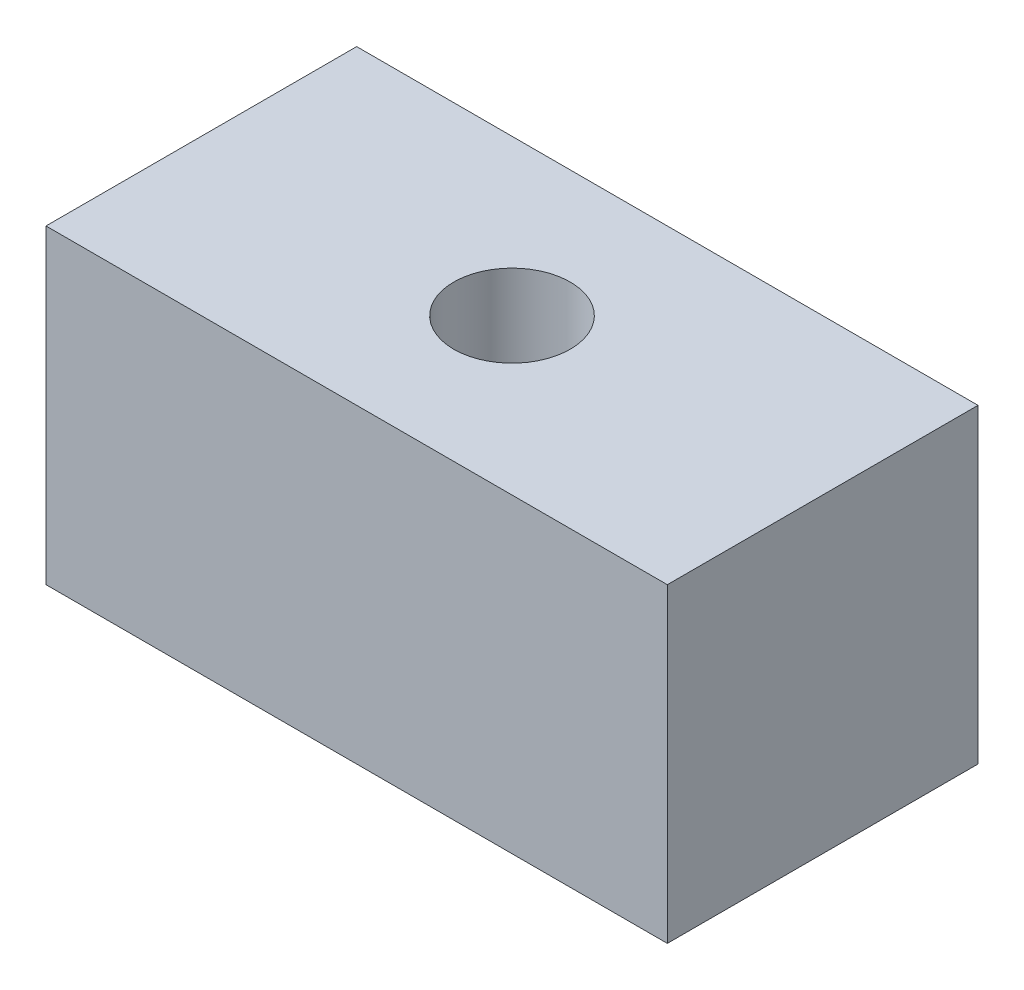
ISO-10303-21;
HEADER;
FILE_DESCRIPTION(('STEP AP214'),'2;1');
FILE_NAME('part.step','',(''),(''),'','','');
FILE_SCHEMA(('AUTOMOTIVE_DESIGN { 1 0 10303 214 1 1 1 1 }'));
ENDSEC;
DATA;
#1=APPLICATION_CONTEXT('core data for automotive mechanical design processes');
#2=APPLICATION_PROTOCOL_DEFINITION('international standard','automotive_design',2000,#1);
#3=PRODUCT_CONTEXT('',#1,'mechanical');
#4=PRODUCT('Part','Part','',(#3));
#5=PRODUCT_RELATED_PRODUCT_CATEGORY('part','',(#4));
#6=PRODUCT_DEFINITION_FORMATION('','',#4);
#7=PRODUCT_DEFINITION_CONTEXT('part definition',#1,'design');
#8=PRODUCT_DEFINITION('design','',#6,#7);
#9=PRODUCT_DEFINITION_SHAPE('','',#8);
#10=(LENGTH_UNIT() NAMED_UNIT(*) SI_UNIT(.MILLI.,.METRE.));
#11=(NAMED_UNIT(*) PLANE_ANGLE_UNIT() SI_UNIT($,.RADIAN.));
#12=(NAMED_UNIT(*) SI_UNIT($,.STERADIAN.) SOLID_ANGLE_UNIT());
#13=UNCERTAINTY_MEASURE_WITH_UNIT(LENGTH_MEASURE(1.E-05),#10,'distance_accuracy_value','');
#14=(GEOMETRIC_REPRESENTATION_CONTEXT(3) GLOBAL_UNCERTAINTY_ASSIGNED_CONTEXT((#13)) GLOBAL_UNIT_ASSIGNED_CONTEXT((#10,
#11,#12)) REPRESENTATION_CONTEXT('',''));
#15=CARTESIAN_POINT('',(0.,0.,0.));
#16=DIRECTION('',(0.,0.,1.));
#17=DIRECTION('',(1.,0.,0.));
#18=AXIS2_PLACEMENT_3D('',#15,#16,#17);
#19=CARTESIAN_POINT('',(0.,0.,50.8));
#20=DIRECTION('',(1.,0.,0.));
#21=DIRECTION('',(0.,0.,-1.));
#22=AXIS2_PLACEMENT_3D('',#19,#20,#21);
#23=PLANE('',#22);
#24=DIRECTION('',(0.,-1.,0.));
#25=VECTOR('',#24,1.);
#26=CARTESIAN_POINT('',(0.,0.,0.));
#27=LINE('',#26,#25);
#28=CARTESIAN_POINT('',(0.,50.8,0.));
#29=VERTEX_POINT('',#28);
#30=CARTESIAN_POINT('',(0.,0.,0.));
#31=VERTEX_POINT('',#30);
#32=EDGE_CURVE('E101',#29,#31,#27,.T.);
#33=ORIENTED_EDGE('',*,*,#32,.T.);
#34=DIRECTION('',(0.,0.,-1.));
#35=VECTOR('',#34,1.);
#36=CARTESIAN_POINT('',(0.,0.,50.8));
#37=LINE('',#36,#35);
#38=CARTESIAN_POINT('',(0.,0.,50.8));
#39=VERTEX_POINT('',#38);
#40=EDGE_CURVE('E11',#39,#31,#37,.T.);
#41=ORIENTED_EDGE('',*,*,#40,.F.);
#42=DIRECTION('',(0.,-1.,0.));
#43=VECTOR('',#42,1.);
#44=CARTESIAN_POINT('',(0.,0.,50.8));
#45=LINE('',#44,#43);
#46=CARTESIAN_POINT('',(0.,50.8,50.8));
#47=VERTEX_POINT('',#46);
#48=EDGE_CURVE('E89',#47,#39,#45,.T.);
#49=ORIENTED_EDGE('',*,*,#48,.F.);
#50=DIRECTION('',(0.,0.,-1.));
#51=VECTOR('',#50,1.);
#52=CARTESIAN_POINT('',(0.,50.8,50.8));
#53=LINE('',#52,#51);
#54=EDGE_CURVE('E97',#47,#29,#53,.T.);
#55=ORIENTED_EDGE('',*,*,#54,.T.);
#56=EDGE_LOOP('',(#33,#41,#49,#55));
#57=FACE_BOUND('',#56,.T.);
#58=ADVANCED_FACE('F38',(#57),#23,.F.);
#59=CARTESIAN_POINT('',(0.,0.,50.8));
#60=DIRECTION('',(0.,1.,0.));
#61=DIRECTION('',(0.,0.,1.));
#62=AXIS2_PLACEMENT_3D('',#59,#60,#61);
#63=PLANE('',#62);
#64=CARTESIAN_POINT('',(50.8,0.,25.4));
#65=DIRECTION('',(0.,1.,0.));
#66=DIRECTION('',(0.,0.,1.));
#67=AXIS2_PLACEMENT_3D('',#64,#65,#66);
#68=CIRCLE('',#67,9.525);
#69=CARTESIAN_POINT('',(50.8,0.,34.925));
#70=VERTEX_POINT('',#69);
#71=EDGE_CURVE('E104',#70,#70,#68,.T.);
#72=ORIENTED_EDGE('',*,*,#71,.T.);
#73=EDGE_LOOP('',(#72));
#74=FACE_BOUND('',#73,.T.);
#75=DIRECTION('',(1.,0.,0.));
#76=VECTOR('',#75,1.);
#77=CARTESIAN_POINT('',(0.,0.,0.));
#78=LINE('',#77,#76);
#79=CARTESIAN_POINT('',(101.6,0.,0.));
#80=VERTEX_POINT('',#79);
#81=EDGE_CURVE('E93',#31,#80,#78,.T.);
#82=ORIENTED_EDGE('',*,*,#81,.T.);
#83=DIRECTION('',(0.,0.,-1.));
#84=VECTOR('',#83,1.);
#85=CARTESIAN_POINT('',(101.6,0.,50.8));
#86=LINE('',#85,#84);
#87=CARTESIAN_POINT('',(101.6,0.,50.8));
#88=VERTEX_POINT('',#87);
#89=EDGE_CURVE('E46',#88,#80,#86,.T.);
#90=ORIENTED_EDGE('',*,*,#89,.F.);
#91=DIRECTION('',(1.,0.,0.));
#92=VECTOR('',#91,1.);
#93=CARTESIAN_POINT('',(0.,0.,50.8));
#94=LINE('',#93,#92);
#95=EDGE_CURVE('E84',#39,#88,#94,.T.);
#96=ORIENTED_EDGE('',*,*,#95,.F.);
#97=ORIENTED_EDGE('',*,*,#40,.T.);
#98=EDGE_LOOP('',(#82,#90,#96,#97));
#99=FACE_BOUND('',#98,.T.);
#100=ADVANCED_FACE('F92',(#74,#99),#63,.F.);
#101=CARTESIAN_POINT('',(101.6,0.,50.8));
#102=DIRECTION('',(-1.,0.,0.));
#103=DIRECTION('',(0.,0.,1.));
#104=AXIS2_PLACEMENT_3D('',#101,#102,#103);
#105=PLANE('',#104);
#106=DIRECTION('',(0.,1.,0.));
#107=VECTOR('',#106,1.);
#108=CARTESIAN_POINT('',(101.6,0.,0.));
#109=LINE('',#108,#107);
#110=CARTESIAN_POINT('',(101.6,50.8,0.));
#111=VERTEX_POINT('',#110);
#112=EDGE_CURVE('E71',#80,#111,#109,.T.);
#113=ORIENTED_EDGE('',*,*,#112,.T.);
#114=DIRECTION('',(0.,0.,-1.));
#115=VECTOR('',#114,1.);
#116=CARTESIAN_POINT('',(101.6,50.8,50.8));
#117=LINE('',#116,#115);
#118=CARTESIAN_POINT('',(101.6,50.8,50.8));
#119=VERTEX_POINT('',#118);
#120=EDGE_CURVE('E94',#119,#111,#117,.T.);
#121=ORIENTED_EDGE('',*,*,#120,.F.);
#122=DIRECTION('',(0.,1.,0.));
#123=VECTOR('',#122,1.);
#124=CARTESIAN_POINT('',(101.6,0.,50.8));
#125=LINE('',#124,#123);
#126=EDGE_CURVE('E87',#88,#119,#125,.T.);
#127=ORIENTED_EDGE('',*,*,#126,.F.);
#128=ORIENTED_EDGE('',*,*,#89,.T.);
#129=EDGE_LOOP('',(#113,#121,#127,#128));
#130=FACE_BOUND('',#129,.T.);
#131=ADVANCED_FACE('F95',(#130),#105,.F.);
#132=CARTESIAN_POINT('',(0.,50.8,50.8));
#133=DIRECTION('',(0.,-1.,0.));
#134=DIRECTION('',(0.,0.,-1.));
#135=AXIS2_PLACEMENT_3D('',#132,#133,#134);
#136=PLANE('',#135);
#137=CARTESIAN_POINT('',(50.8,50.8,25.4));
#138=DIRECTION('',(0.,1.,0.));
#139=DIRECTION('',(0.,0.,1.));
#140=AXIS2_PLACEMENT_3D('',#137,#138,#139);
#141=CIRCLE('',#140,9.525);
#142=CARTESIAN_POINT('',(50.8,50.8,34.925));
#143=VERTEX_POINT('',#142);
#144=EDGE_CURVE('E115',#143,#143,#141,.T.);
#145=ORIENTED_EDGE('',*,*,#144,.F.);
#146=EDGE_LOOP('',(#145));
#147=FACE_BOUND('',#146,.T.);
#148=DIRECTION('',(-1.,0.,0.));
#149=VECTOR('',#148,1.);
#150=CARTESIAN_POINT('',(0.,50.8,0.));
#151=LINE('',#150,#149);
#152=EDGE_CURVE('E77',#111,#29,#151,.T.);
#153=ORIENTED_EDGE('',*,*,#152,.T.);
#154=ORIENTED_EDGE('',*,*,#54,.F.);
#155=DIRECTION('',(-1.,0.,0.));
#156=VECTOR('',#155,1.);
#157=CARTESIAN_POINT('',(0.,50.8,50.8));
#158=LINE('',#157,#156);
#159=EDGE_CURVE('E54',#119,#47,#158,.T.);
#160=ORIENTED_EDGE('',*,*,#159,.F.);
#161=ORIENTED_EDGE('',*,*,#120,.T.);
#162=EDGE_LOOP('',(#153,#154,#160,#161));
#163=FACE_BOUND('',#162,.T.);
#164=ADVANCED_FACE('F109',(#147,#163),#136,.F.);
#165=CARTESIAN_POINT('',(0.,0.,50.8));
#166=DIRECTION('',(0.,0.,-1.));
#167=DIRECTION('',(-1.,0.,0.));
#168=AXIS2_PLACEMENT_3D('',#165,#166,#167);
#169=PLANE('',#168);
#170=ORIENTED_EDGE('',*,*,#48,.T.);
#171=ORIENTED_EDGE('',*,*,#95,.T.);
#172=ORIENTED_EDGE('',*,*,#126,.T.);
#173=ORIENTED_EDGE('',*,*,#159,.T.);
#174=EDGE_LOOP('',(#170,#171,#172,#173));
#175=FACE_BOUND('',#174,.T.);
#176=ADVANCED_FACE('F85',(#175),#169,.F.);
#177=CARTESIAN_POINT('',(0.,0.,0.));
#178=DIRECTION('',(0.,0.,-1.));
#179=DIRECTION('',(-1.,0.,0.));
#180=AXIS2_PLACEMENT_3D('',#177,#178,#179);
#181=PLANE('',#180);
#182=ORIENTED_EDGE('',*,*,#32,.F.);
#183=ORIENTED_EDGE('',*,*,#152,.F.);
#184=ORIENTED_EDGE('',*,*,#112,.F.);
#185=ORIENTED_EDGE('',*,*,#81,.F.);
#186=EDGE_LOOP('',(#182,#183,#184,#185));
#187=FACE_BOUND('',#186,.T.);
#188=ADVANCED_FACE('F112',(#187),#181,.T.);
#189=CARTESIAN_POINT('',(50.8,0.,25.4));
#190=DIRECTION('',(0.,1.,0.));
#191=DIRECTION('',(0.,0.,1.));
#192=AXIS2_PLACEMENT_3D('',#189,#190,#191);
#193=CYLINDRICAL_SURFACE('',#192,9.525);
#194=ORIENTED_EDGE('',*,*,#71,.F.);
#195=EDGE_LOOP('',(#194));
#196=FACE_BOUND('',#195,.T.);
#197=ORIENTED_EDGE('',*,*,#144,.T.);
#198=EDGE_LOOP('',(#197));
#199=FACE_BOUND('',#198,.T.);
#200=ADVANCED_FACE('F122',(#196,#199),#193,.F.);
#201=CLOSED_SHELL('',(#58,#100,#131,#164,#176,#188,#200));
#202=MANIFOLD_SOLID_BREP('B2',#201);
#203=ADVANCED_BREP_SHAPE_REPRESENTATION('',(#18,#202),#14);
#204=SHAPE_DEFINITION_REPRESENTATION(#9,#203);
ENDSEC;
END-ISO-10303-21;
